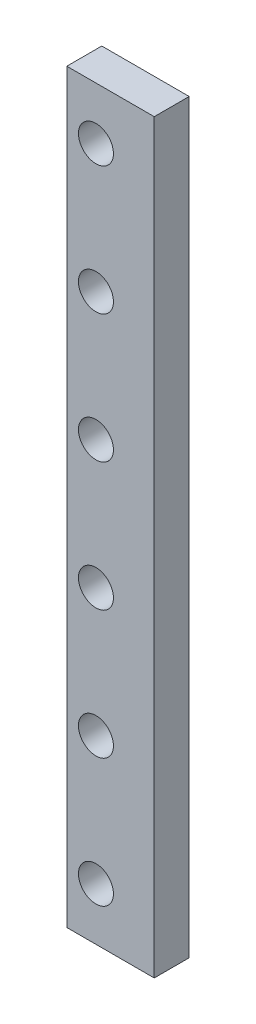
ISO-10303-21;
HEADER;
FILE_DESCRIPTION(('STEP AP214'),'2;1');
FILE_NAME('part.step','',(''),(''),'','','');
FILE_SCHEMA(('AUTOMOTIVE_DESIGN { 1 0 10303 214 1 1 1 1 }'));
ENDSEC;
DATA;
#1=APPLICATION_CONTEXT('core data for automotive mechanical design processes');
#2=APPLICATION_PROTOCOL_DEFINITION('international standard','automotive_design',2000,#1);
#3=PRODUCT_CONTEXT('',#1,'mechanical');
#4=PRODUCT('Part','Part','',(#3));
#5=PRODUCT_RELATED_PRODUCT_CATEGORY('part','',(#4));
#6=PRODUCT_DEFINITION_FORMATION('','',#4);
#7=PRODUCT_DEFINITION_CONTEXT('part definition',#1,'design');
#8=PRODUCT_DEFINITION('design','',#6,#7);
#9=PRODUCT_DEFINITION_SHAPE('','',#8);
#10=(LENGTH_UNIT() NAMED_UNIT(*) SI_UNIT(.MILLI.,.METRE.));
#11=(NAMED_UNIT(*) PLANE_ANGLE_UNIT() SI_UNIT($,.RADIAN.));
#12=(NAMED_UNIT(*) SI_UNIT($,.STERADIAN.) SOLID_ANGLE_UNIT());
#13=UNCERTAINTY_MEASURE_WITH_UNIT(LENGTH_MEASURE(1.E-05),#10,'distance_accuracy_value','');
#14=(GEOMETRIC_REPRESENTATION_CONTEXT(3) GLOBAL_UNCERTAINTY_ASSIGNED_CONTEXT((#13)) GLOBAL_UNIT_ASSIGNED_CONTEXT((#10,
#11,#12)) REPRESENTATION_CONTEXT('',''));
#15=CARTESIAN_POINT('',(0.,0.,0.));
#16=DIRECTION('',(0.,0.,1.));
#17=DIRECTION('',(1.,0.,0.));
#18=AXIS2_PLACEMENT_3D('',#15,#16,#17);
#19=CARTESIAN_POINT('',(11.90625,101.6,4.7625));
#20=DIRECTION('',(-1.,0.,0.));
#21=DIRECTION('',(0.,-1.,0.));
#22=AXIS2_PLACEMENT_3D('',#19,#20,#21);
#23=PLANE('',#22);
#24=DIRECTION('',(0.,1.,0.));
#25=VECTOR('',#24,1.);
#26=CARTESIAN_POINT('',(11.90625,101.6,-4.7625));
#27=LINE('',#26,#25);
#28=CARTESIAN_POINT('',(11.90625,-101.6,-4.7625));
#29=VERTEX_POINT('',#28);
#30=CARTESIAN_POINT('',(11.90625,101.6,-4.7625));
#31=VERTEX_POINT('',#30);
#32=EDGE_CURVE('E96',#29,#31,#27,.T.);
#33=ORIENTED_EDGE('',*,*,#32,.T.);
#34=DIRECTION('',(0.,0.,-1.));
#35=VECTOR('',#34,1.);
#36=CARTESIAN_POINT('',(11.90625,101.6,4.7625));
#37=LINE('',#36,#35);
#38=CARTESIAN_POINT('',(11.90625,101.6,4.7625));
#39=VERTEX_POINT('',#38);
#40=EDGE_CURVE('E11',#39,#31,#37,.T.);
#41=ORIENTED_EDGE('',*,*,#40,.F.);
#42=DIRECTION('',(0.,1.,0.));
#43=VECTOR('',#42,1.);
#44=CARTESIAN_POINT('',(11.90625,101.6,4.7625));
#45=LINE('',#44,#43);
#46=CARTESIAN_POINT('',(11.90625,-101.6,4.7625));
#47=VERTEX_POINT('',#46);
#48=EDGE_CURVE('E84',#47,#39,#45,.T.);
#49=ORIENTED_EDGE('',*,*,#48,.F.);
#50=DIRECTION('',(0.,0.,-1.));
#51=VECTOR('',#50,1.);
#52=CARTESIAN_POINT('',(11.90625,-101.6,4.7625));
#53=LINE('',#52,#51);
#54=EDGE_CURVE('E92',#47,#29,#53,.T.);
#55=ORIENTED_EDGE('',*,*,#54,.T.);
#56=EDGE_LOOP('',(#33,#41,#49,#55));
#57=FACE_BOUND('',#56,.T.);
#58=ADVANCED_FACE('F33',(#57),#23,.F.);
#59=CARTESIAN_POINT('',(-11.90625,101.6,4.7625));
#60=DIRECTION('',(0.,-1.,0.));
#61=DIRECTION('',(0.,0.,-1.));
#62=AXIS2_PLACEMENT_3D('',#59,#60,#61);
#63=PLANE('',#62);
#64=DIRECTION('',(-1.,0.,0.));
#65=VECTOR('',#64,1.);
#66=CARTESIAN_POINT('',(-11.90625,101.6,-4.7625));
#67=LINE('',#66,#65);
#68=CARTESIAN_POINT('',(-11.90625,101.6,-4.7625));
#69=VERTEX_POINT('',#68);
#70=EDGE_CURVE('E88',#31,#69,#67,.T.);
#71=ORIENTED_EDGE('',*,*,#70,.T.);
#72=DIRECTION('',(0.,0.,-1.));
#73=VECTOR('',#72,1.);
#74=CARTESIAN_POINT('',(-11.90625,101.6,4.7625));
#75=LINE('',#74,#73);
#76=CARTESIAN_POINT('',(-11.90625,101.6,4.7625));
#77=VERTEX_POINT('',#76);
#78=EDGE_CURVE('E41',#77,#69,#75,.T.);
#79=ORIENTED_EDGE('',*,*,#78,.F.);
#80=DIRECTION('',(-1.,0.,0.));
#81=VECTOR('',#80,1.);
#82=CARTESIAN_POINT('',(-11.90625,101.6,4.7625));
#83=LINE('',#82,#81);
#84=EDGE_CURVE('E79',#39,#77,#83,.T.);
#85=ORIENTED_EDGE('',*,*,#84,.F.);
#86=ORIENTED_EDGE('',*,*,#40,.T.);
#87=EDGE_LOOP('',(#71,#79,#85,#86));
#88=FACE_BOUND('',#87,.T.);
#89=ADVANCED_FACE('F87',(#88),#63,.F.);
#90=CARTESIAN_POINT('',(-11.90625,101.6,4.7625));
#91=DIRECTION('',(1.,0.,0.));
#92=DIRECTION('',(0.,1.,0.));
#93=AXIS2_PLACEMENT_3D('',#90,#91,#92);
#94=PLANE('',#93);
#95=DIRECTION('',(0.,-1.,0.));
#96=VECTOR('',#95,1.);
#97=CARTESIAN_POINT('',(-11.90625,101.6,-4.7625));
#98=LINE('',#97,#96);
#99=CARTESIAN_POINT('',(-11.90625,-101.6,-4.7625));
#100=VERTEX_POINT('',#99);
#101=EDGE_CURVE('E66',#69,#100,#98,.T.);
#102=ORIENTED_EDGE('',*,*,#101,.T.);
#103=DIRECTION('',(0.,0.,-1.));
#104=VECTOR('',#103,1.);
#105=CARTESIAN_POINT('',(-11.90625,-101.6,4.7625));
#106=LINE('',#105,#104);
#107=CARTESIAN_POINT('',(-11.90625,-101.6,4.7625));
#108=VERTEX_POINT('',#107);
#109=EDGE_CURVE('E89',#108,#100,#106,.T.);
#110=ORIENTED_EDGE('',*,*,#109,.F.);
#111=DIRECTION('',(0.,-1.,0.));
#112=VECTOR('',#111,1.);
#113=CARTESIAN_POINT('',(-11.90625,101.6,4.7625));
#114=LINE('',#113,#112);
#115=EDGE_CURVE('E82',#77,#108,#114,.T.);
#116=ORIENTED_EDGE('',*,*,#115,.F.);
#117=ORIENTED_EDGE('',*,*,#78,.T.);
#118=EDGE_LOOP('',(#102,#110,#116,#117));
#119=FACE_BOUND('',#118,.T.);
#120=ADVANCED_FACE('F90',(#119),#94,.F.);
#121=CARTESIAN_POINT('',(-11.90625,-101.6,4.7625));
#122=DIRECTION('',(0.,1.,0.));
#123=DIRECTION('',(0.,0.,1.));
#124=AXIS2_PLACEMENT_3D('',#121,#122,#123);
#125=PLANE('',#124);
#126=DIRECTION('',(1.,0.,0.));
#127=VECTOR('',#126,1.);
#128=CARTESIAN_POINT('',(-11.90625,-101.6,-4.7625));
#129=LINE('',#128,#127);
#130=EDGE_CURVE('E72',#100,#29,#129,.T.);
#131=ORIENTED_EDGE('',*,*,#130,.T.);
#132=ORIENTED_EDGE('',*,*,#54,.F.);
#133=DIRECTION('',(1.,0.,0.));
#134=VECTOR('',#133,1.);
#135=CARTESIAN_POINT('',(-11.90625,-101.6,4.7625));
#136=LINE('',#135,#134);
#137=EDGE_CURVE('E49',#108,#47,#136,.T.);
#138=ORIENTED_EDGE('',*,*,#137,.F.);
#139=ORIENTED_EDGE('',*,*,#109,.T.);
#140=EDGE_LOOP('',(#131,#132,#138,#139));
#141=FACE_BOUND('',#140,.T.);
#142=ADVANCED_FACE('F104',(#141),#125,.F.);
#143=CARTESIAN_POINT('',(0.,0.,4.7625));
#144=DIRECTION('',(0.,0.,1.));
#145=DIRECTION('',(1.,0.,0.));
#146=AXIS2_PLACEMENT_3D('',#143,#144,#145);
#147=PLANE('',#146);
#148=CARTESIAN_POINT('',(-3.96874999999999,87.3125,4.7625));
#149=DIRECTION('',(0.,0.,1.));
#150=DIRECTION('',(1.,0.,0.));
#151=AXIS2_PLACEMENT_3D('',#148,#149,#150);
#152=CIRCLE('',#151,4.76249999999999);
#153=CARTESIAN_POINT('',(0.793749999999994,87.3125,4.7625));
#154=VERTEX_POINT('',#153);
#155=EDGE_CURVE('E142',#154,#154,#152,.T.);
#156=ORIENTED_EDGE('',*,*,#155,.F.);
#157=EDGE_LOOP('',(#156));
#158=FACE_BOUND('',#157,.T.);
#159=CARTESIAN_POINT('',(-3.96874999999997,-87.3125,4.7625));
#160=DIRECTION('',(0.,0.,1.));
#161=DIRECTION('',(1.,0.,0.));
#162=AXIS2_PLACEMENT_3D('',#159,#160,#161);
#163=CIRCLE('',#162,4.76249999999999);
#164=CARTESIAN_POINT('',(0.793750000000016,-87.3125,4.7625));
#165=VERTEX_POINT('',#164);
#166=EDGE_CURVE('E136',#165,#165,#163,.T.);
#167=ORIENTED_EDGE('',*,*,#166,.F.);
#168=EDGE_LOOP('',(#167));
#169=FACE_BOUND('',#168,.T.);
#170=CARTESIAN_POINT('',(-3.96874999999998,-52.3875,4.7625));
#171=DIRECTION('',(0.,0.,1.));
#172=DIRECTION('',(1.,0.,0.));
#173=AXIS2_PLACEMENT_3D('',#170,#171,#172);
#174=CIRCLE('',#173,4.76249999999999);
#175=CARTESIAN_POINT('',(0.793750000000012,-52.3875,4.7625));
#176=VERTEX_POINT('',#175);
#177=EDGE_CURVE('E130',#176,#176,#174,.T.);
#178=ORIENTED_EDGE('',*,*,#177,.F.);
#179=EDGE_LOOP('',(#178));
#180=FACE_BOUND('',#179,.T.);
#181=CARTESIAN_POINT('',(-3.96874999999998,-17.4625,4.7625));
#182=DIRECTION('',(0.,0.,1.));
#183=DIRECTION('',(1.,0.,0.));
#184=AXIS2_PLACEMENT_3D('',#181,#182,#183);
#185=CIRCLE('',#184,4.76249999999999);
#186=CARTESIAN_POINT('',(0.793750000000006,-17.4625,4.7625));
#187=VERTEX_POINT('',#186);
#188=EDGE_CURVE('E124',#187,#187,#185,.T.);
#189=ORIENTED_EDGE('',*,*,#188,.F.);
#190=EDGE_LOOP('',(#189));
#191=FACE_BOUND('',#190,.T.);
#192=CARTESIAN_POINT('',(-3.96874999999999,17.4625,4.7625));
#193=DIRECTION('',(0.,0.,1.));
#194=DIRECTION('',(1.,0.,0.));
#195=AXIS2_PLACEMENT_3D('',#192,#193,#194);
#196=CIRCLE('',#195,4.76249999999999);
#197=CARTESIAN_POINT('',(0.793750000000002,17.4625,4.7625));
#198=VERTEX_POINT('',#197);
#199=EDGE_CURVE('E118',#198,#198,#196,.T.);
#200=ORIENTED_EDGE('',*,*,#199,.F.);
#201=EDGE_LOOP('',(#200));
#202=FACE_BOUND('',#201,.T.);
#203=CARTESIAN_POINT('',(-3.96874999999999,52.3875,4.7625));
#204=DIRECTION('',(0.,0.,1.));
#205=DIRECTION('',(1.,0.,0.));
#206=AXIS2_PLACEMENT_3D('',#203,#204,#205);
#207=CIRCLE('',#206,4.76249999999999);
#208=CARTESIAN_POINT('',(0.793749999999999,52.3875,4.7625));
#209=VERTEX_POINT('',#208);
#210=EDGE_CURVE('E112',#209,#209,#207,.T.);
#211=ORIENTED_EDGE('',*,*,#210,.F.);
#212=EDGE_LOOP('',(#211));
#213=FACE_BOUND('',#212,.T.);
#214=ORIENTED_EDGE('',*,*,#48,.T.);
#215=ORIENTED_EDGE('',*,*,#84,.T.);
#216=ORIENTED_EDGE('',*,*,#115,.T.);
#217=ORIENTED_EDGE('',*,*,#137,.T.);
#218=EDGE_LOOP('',(#214,#215,#216,#217));
#219=FACE_BOUND('',#218,.T.);
#220=ADVANCED_FACE('F80',(#158,#169,#180,#191,#202,#213,#219),#147,.T.);
#221=CARTESIAN_POINT('',(0.,0.,-4.7625));
#222=DIRECTION('',(0.,0.,1.));
#223=DIRECTION('',(1.,0.,0.));
#224=AXIS2_PLACEMENT_3D('',#221,#222,#223);
#225=PLANE('',#224);
#226=CARTESIAN_POINT('',(-3.96874999999999,87.3125,-4.7625));
#227=DIRECTION('',(0.,0.,1.));
#228=DIRECTION('',(1.,0.,0.));
#229=AXIS2_PLACEMENT_3D('',#226,#227,#228);
#230=CIRCLE('',#229,4.76249999999999);
#231=CARTESIAN_POINT('',(0.793749999999999,87.3125,-4.7625));
#232=VERTEX_POINT('',#231);
#233=EDGE_CURVE('E139',#232,#232,#230,.T.);
#234=ORIENTED_EDGE('',*,*,#233,.T.);
#235=EDGE_LOOP('',(#234));
#236=FACE_BOUND('',#235,.T.);
#237=CARTESIAN_POINT('',(-3.96874999999997,-87.3125,-4.7625));
#238=DIRECTION('',(0.,0.,1.));
#239=DIRECTION('',(1.,0.,0.));
#240=AXIS2_PLACEMENT_3D('',#237,#238,#239);
#241=CIRCLE('',#240,4.76249999999999);
#242=CARTESIAN_POINT('',(0.793750000000021,-87.3125,-4.7625));
#243=VERTEX_POINT('',#242);
#244=EDGE_CURVE('E133',#243,#243,#241,.T.);
#245=ORIENTED_EDGE('',*,*,#244,.T.);
#246=EDGE_LOOP('',(#245));
#247=FACE_BOUND('',#246,.T.);
#248=CARTESIAN_POINT('',(-3.96874999999998,-52.3875,-4.7625));
#249=DIRECTION('',(0.,0.,1.));
#250=DIRECTION('',(1.,0.,0.));
#251=AXIS2_PLACEMENT_3D('',#248,#249,#250);
#252=CIRCLE('',#251,4.76249999999999);
#253=CARTESIAN_POINT('',(0.793750000000017,-52.3875,-4.7625));
#254=VERTEX_POINT('',#253);
#255=EDGE_CURVE('E127',#254,#254,#252,.T.);
#256=ORIENTED_EDGE('',*,*,#255,.T.);
#257=EDGE_LOOP('',(#256));
#258=FACE_BOUND('',#257,.T.);
#259=CARTESIAN_POINT('',(-3.96874999999998,-17.4625,-4.7625));
#260=DIRECTION('',(0.,0.,1.));
#261=DIRECTION('',(1.,0.,0.));
#262=AXIS2_PLACEMENT_3D('',#259,#260,#261);
#263=CIRCLE('',#262,4.76249999999999);
#264=CARTESIAN_POINT('',(0.793750000000012,-17.4625,-4.7625));
#265=VERTEX_POINT('',#264);
#266=EDGE_CURVE('E121',#265,#265,#263,.T.);
#267=ORIENTED_EDGE('',*,*,#266,.T.);
#268=EDGE_LOOP('',(#267));
#269=FACE_BOUND('',#268,.T.);
#270=CARTESIAN_POINT('',(-3.96874999999999,17.4625,-4.7625));
#271=DIRECTION('',(0.,0.,1.));
#272=DIRECTION('',(1.,0.,0.));
#273=AXIS2_PLACEMENT_3D('',#270,#271,#272);
#274=CIRCLE('',#273,4.76249999999999);
#275=CARTESIAN_POINT('',(0.793750000000007,17.4625,-4.7625));
#276=VERTEX_POINT('',#275);
#277=EDGE_CURVE('E115',#276,#276,#274,.T.);
#278=ORIENTED_EDGE('',*,*,#277,.T.);
#279=EDGE_LOOP('',(#278));
#280=FACE_BOUND('',#279,.T.);
#281=CARTESIAN_POINT('',(-3.96874999999999,52.3875,-4.7625));
#282=DIRECTION('',(0.,0.,1.));
#283=DIRECTION('',(1.,0.,0.));
#284=AXIS2_PLACEMENT_3D('',#281,#282,#283);
#285=CIRCLE('',#284,4.76249999999999);
#286=CARTESIAN_POINT('',(0.793750000000005,52.3875,-4.7625));
#287=VERTEX_POINT('',#286);
#288=EDGE_CURVE('E99',#287,#287,#285,.T.);
#289=ORIENTED_EDGE('',*,*,#288,.T.);
#290=EDGE_LOOP('',(#289));
#291=FACE_BOUND('',#290,.T.);
#292=ORIENTED_EDGE('',*,*,#32,.F.);
#293=ORIENTED_EDGE('',*,*,#130,.F.);
#294=ORIENTED_EDGE('',*,*,#101,.F.);
#295=ORIENTED_EDGE('',*,*,#70,.F.);
#296=EDGE_LOOP('',(#292,#293,#294,#295));
#297=FACE_BOUND('',#296,.T.);
#298=ADVANCED_FACE('F107',(#236,#247,#258,#269,#280,#291,#297),#225,.F.);
#299=CARTESIAN_POINT('',(-3.96874999999999,52.3875,4.7625));
#300=DIRECTION('',(0.,0.,1.));
#301=DIRECTION('',(1.,0.,0.));
#302=AXIS2_PLACEMENT_3D('',#299,#300,#301);
#303=CYLINDRICAL_SURFACE('',#302,4.76249999999999);
#304=ORIENTED_EDGE('',*,*,#288,.F.);
#305=EDGE_LOOP('',(#304));
#306=FACE_BOUND('',#305,.T.);
#307=ORIENTED_EDGE('',*,*,#210,.T.);
#308=EDGE_LOOP('',(#307));
#309=FACE_BOUND('',#308,.T.);
#310=ADVANCED_FACE('F161',(#306,#309),#303,.F.);
#311=CARTESIAN_POINT('',(-3.96874999999999,17.4625,4.7625));
#312=DIRECTION('',(0.,0.,1.));
#313=DIRECTION('',(1.,0.,0.));
#314=AXIS2_PLACEMENT_3D('',#311,#312,#313);
#315=CYLINDRICAL_SURFACE('',#314,4.76249999999999);
#316=ORIENTED_EDGE('',*,*,#277,.F.);
#317=EDGE_LOOP('',(#316));
#318=FACE_BOUND('',#317,.T.);
#319=ORIENTED_EDGE('',*,*,#199,.T.);
#320=EDGE_LOOP('',(#319));
#321=FACE_BOUND('',#320,.T.);
#322=ADVANCED_FACE('F163',(#318,#321),#315,.F.);
#323=CARTESIAN_POINT('',(-3.96874999999998,-17.4625,4.7625));
#324=DIRECTION('',(0.,0.,1.));
#325=DIRECTION('',(1.,0.,0.));
#326=AXIS2_PLACEMENT_3D('',#323,#324,#325);
#327=CYLINDRICAL_SURFACE('',#326,4.76249999999999);
#328=ORIENTED_EDGE('',*,*,#266,.F.);
#329=EDGE_LOOP('',(#328));
#330=FACE_BOUND('',#329,.T.);
#331=ORIENTED_EDGE('',*,*,#188,.T.);
#332=EDGE_LOOP('',(#331));
#333=FACE_BOUND('',#332,.T.);
#334=ADVANCED_FACE('F170',(#330,#333),#327,.F.);
#335=CARTESIAN_POINT('',(-3.96874999999998,-52.3875,4.7625));
#336=DIRECTION('',(0.,0.,1.));
#337=DIRECTION('',(1.,0.,0.));
#338=AXIS2_PLACEMENT_3D('',#335,#336,#337);
#339=CYLINDRICAL_SURFACE('',#338,4.76249999999999);
#340=ORIENTED_EDGE('',*,*,#255,.F.);
#341=EDGE_LOOP('',(#340));
#342=FACE_BOUND('',#341,.T.);
#343=ORIENTED_EDGE('',*,*,#177,.T.);
#344=EDGE_LOOP('',(#343));
#345=FACE_BOUND('',#344,.T.);
#346=ADVANCED_FACE('F217',(#342,#345),#339,.F.);
#347=CARTESIAN_POINT('',(-3.96874999999997,-87.3125,4.7625));
#348=DIRECTION('',(0.,0.,1.));
#349=DIRECTION('',(1.,0.,0.));
#350=AXIS2_PLACEMENT_3D('',#347,#348,#349);
#351=CYLINDRICAL_SURFACE('',#350,4.76249999999999);
#352=ORIENTED_EDGE('',*,*,#244,.F.);
#353=EDGE_LOOP('',(#352));
#354=FACE_BOUND('',#353,.T.);
#355=ORIENTED_EDGE('',*,*,#166,.T.);
#356=EDGE_LOOP('',(#355));
#357=FACE_BOUND('',#356,.T.);
#358=ADVANCED_FACE('F227',(#354,#357),#351,.F.);
#359=CARTESIAN_POINT('',(-3.96874999999999,87.3125,4.7625));
#360=DIRECTION('',(0.,0.,1.));
#361=DIRECTION('',(1.,0.,0.));
#362=AXIS2_PLACEMENT_3D('',#359,#360,#361);
#363=CYLINDRICAL_SURFACE('',#362,4.76249999999999);
#364=ORIENTED_EDGE('',*,*,#233,.F.);
#365=EDGE_LOOP('',(#364));
#366=FACE_BOUND('',#365,.T.);
#367=ORIENTED_EDGE('',*,*,#155,.T.);
#368=EDGE_LOOP('',(#367));
#369=FACE_BOUND('',#368,.T.);
#370=ADVANCED_FACE('F146',(#366,#369),#363,.F.);
#371=CLOSED_SHELL('',(#58,#89,#120,#142,#220,#298,#310,#322,#334,#346,#358,#370));
#372=MANIFOLD_SOLID_BREP('B2',#371);
#373=ADVANCED_BREP_SHAPE_REPRESENTATION('',(#18,#372),#14);
#374=SHAPE_DEFINITION_REPRESENTATION(#9,#373);
ENDSEC;
END-ISO-10303-21;
